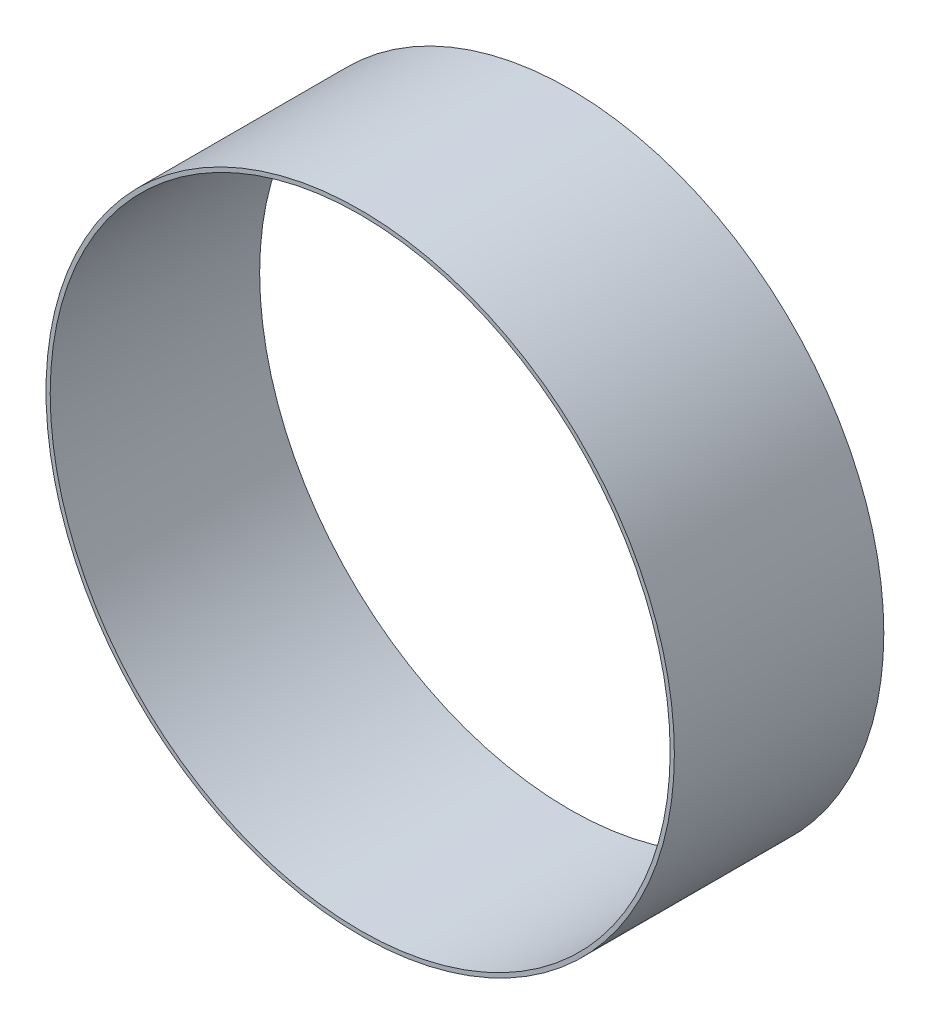
ISO-10303-21;
HEADER;
FILE_DESCRIPTION(('STEP AP214'),'2;1');
FILE_NAME('part.step','',(''),(''),'','','');
FILE_SCHEMA(('AUTOMOTIVE_DESIGN { 1 0 10303 214 1 1 1 1 }'));
ENDSEC;
DATA;
#1=APPLICATION_CONTEXT('core data for automotive mechanical design processes');
#2=APPLICATION_PROTOCOL_DEFINITION('international standard','automotive_design',2000,#1);
#3=PRODUCT_CONTEXT('',#1,'mechanical');
#4=PRODUCT('Part','Part','',(#3));
#5=PRODUCT_RELATED_PRODUCT_CATEGORY('part','',(#4));
#6=PRODUCT_DEFINITION_FORMATION('','',#4);
#7=PRODUCT_DEFINITION_CONTEXT('part definition',#1,'design');
#8=PRODUCT_DEFINITION('design','',#6,#7);
#9=PRODUCT_DEFINITION_SHAPE('','',#8);
#10=(LENGTH_UNIT() NAMED_UNIT(*) SI_UNIT(.MILLI.,.METRE.));
#11=(NAMED_UNIT(*) PLANE_ANGLE_UNIT() SI_UNIT($,.RADIAN.));
#12=(NAMED_UNIT(*) SI_UNIT($,.STERADIAN.) SOLID_ANGLE_UNIT());
#13=UNCERTAINTY_MEASURE_WITH_UNIT(LENGTH_MEASURE(1.E-05),#10,'distance_accuracy_value','');
#14=(GEOMETRIC_REPRESENTATION_CONTEXT(3) GLOBAL_UNCERTAINTY_ASSIGNED_CONTEXT((#13)) GLOBAL_UNIT_ASSIGNED_CONTEXT((#10,
#11,#12)) REPRESENTATION_CONTEXT('',''));
#15=CARTESIAN_POINT('',(0.,0.,0.));
#16=DIRECTION('',(0.,0.,1.));
#17=DIRECTION('',(1.,0.,0.));
#18=AXIS2_PLACEMENT_3D('',#15,#16,#17);
#19=CARTESIAN_POINT('',(0.,0.,100.));
#20=DIRECTION('',(0.,0.,1.));
#21=DIRECTION('',(1.,0.,0.));
#22=AXIS2_PLACEMENT_3D('',#19,#20,#21);
#23=PLANE('',#22);
#24=CARTESIAN_POINT('',(0.,0.,100.));
#25=DIRECTION('',(0.,0.,1.));
#26=DIRECTION('',(1.,0.,0.));
#27=AXIS2_PLACEMENT_3D('',#24,#25,#26);
#28=CIRCLE('',#27,150.);
#29=CARTESIAN_POINT('',(150.,0.,100.));
#30=VERTEX_POINT('',#29);
#31=EDGE_CURVE('E10',#30,#30,#28,.T.);
#32=ORIENTED_EDGE('',*,*,#31,.T.);
#33=EDGE_LOOP('',(#32));
#34=FACE_BOUND('',#33,.T.);
#35=CARTESIAN_POINT('',(0.,0.,100.));
#36=DIRECTION('',(0.,0.,1.));
#37=DIRECTION('',(1.,0.,0.));
#38=AXIS2_PLACEMENT_3D('',#35,#36,#37);
#39=CIRCLE('',#38,148.);
#40=CARTESIAN_POINT('',(148.,0.,100.));
#41=VERTEX_POINT('',#40);
#42=EDGE_CURVE('E45',#41,#41,#39,.T.);
#43=ORIENTED_EDGE('',*,*,#42,.F.);
#44=EDGE_LOOP('',(#43));
#45=FACE_BOUND('',#44,.T.);
#46=ADVANCED_FACE('F34',(#34,#45),#23,.T.);
#47=CARTESIAN_POINT('',(0.,0.,0.));
#48=DIRECTION('',(0.,0.,1.));
#49=DIRECTION('',(1.,0.,0.));
#50=AXIS2_PLACEMENT_3D('',#47,#48,#49);
#51=PLANE('',#50);
#52=CARTESIAN_POINT('',(0.,0.,0.));
#53=DIRECTION('',(0.,0.,1.));
#54=DIRECTION('',(1.,0.,0.));
#55=AXIS2_PLACEMENT_3D('',#52,#53,#54);
#56=CIRCLE('',#55,150.);
#57=CARTESIAN_POINT('',(150.,0.,0.));
#58=VERTEX_POINT('',#57);
#59=EDGE_CURVE('E38',#58,#58,#56,.T.);
#60=ORIENTED_EDGE('',*,*,#59,.F.);
#61=EDGE_LOOP('',(#60));
#62=FACE_BOUND('',#61,.T.);
#63=CARTESIAN_POINT('',(0.,0.,0.));
#64=DIRECTION('',(0.,0.,1.));
#65=DIRECTION('',(1.,0.,0.));
#66=AXIS2_PLACEMENT_3D('',#63,#64,#65);
#67=CIRCLE('',#66,148.);
#68=CARTESIAN_POINT('',(148.,0.,0.));
#69=VERTEX_POINT('',#68);
#70=EDGE_CURVE('E47',#69,#69,#67,.T.);
#71=ORIENTED_EDGE('',*,*,#70,.T.);
#72=EDGE_LOOP('',(#71));
#73=FACE_BOUND('',#72,.T.);
#74=ADVANCED_FACE('F57',(#62,#73),#51,.F.);
#75=CARTESIAN_POINT('',(0.,0.,100.));
#76=DIRECTION('',(0.,0.,-1.));
#77=DIRECTION('',(-1.,0.,0.));
#78=AXIS2_PLACEMENT_3D('',#75,#76,#77);
#79=CYLINDRICAL_SURFACE('',#78,150.);
#80=ORIENTED_EDGE('',*,*,#31,.F.);
#81=EDGE_LOOP('',(#80));
#82=FACE_BOUND('',#81,.T.);
#83=ORIENTED_EDGE('',*,*,#59,.T.);
#84=EDGE_LOOP('',(#83));
#85=FACE_BOUND('',#84,.T.);
#86=ADVANCED_FACE('F36',(#82,#85),#79,.T.);
#87=CARTESIAN_POINT('',(0.,0.,100.));
#88=DIRECTION('',(0.,0.,-1.));
#89=DIRECTION('',(-1.,0.,0.));
#90=AXIS2_PLACEMENT_3D('',#87,#88,#89);
#91=CYLINDRICAL_SURFACE('',#90,148.);
#92=ORIENTED_EDGE('',*,*,#42,.T.);
#93=EDGE_LOOP('',(#92));
#94=FACE_BOUND('',#93,.T.);
#95=ORIENTED_EDGE('',*,*,#70,.F.);
#96=EDGE_LOOP('',(#95));
#97=FACE_BOUND('',#96,.T.);
#98=ADVANCED_FACE('F53',(#94,#97),#91,.F.);
#99=CLOSED_SHELL('',(#46,#74,#86,#98));
#100=MANIFOLD_SOLID_BREP('B2',#99);
#101=ADVANCED_BREP_SHAPE_REPRESENTATION('',(#18,#100),#14);
#102=SHAPE_DEFINITION_REPRESENTATION(#9,#101);
ENDSEC;
END-ISO-10303-21;
